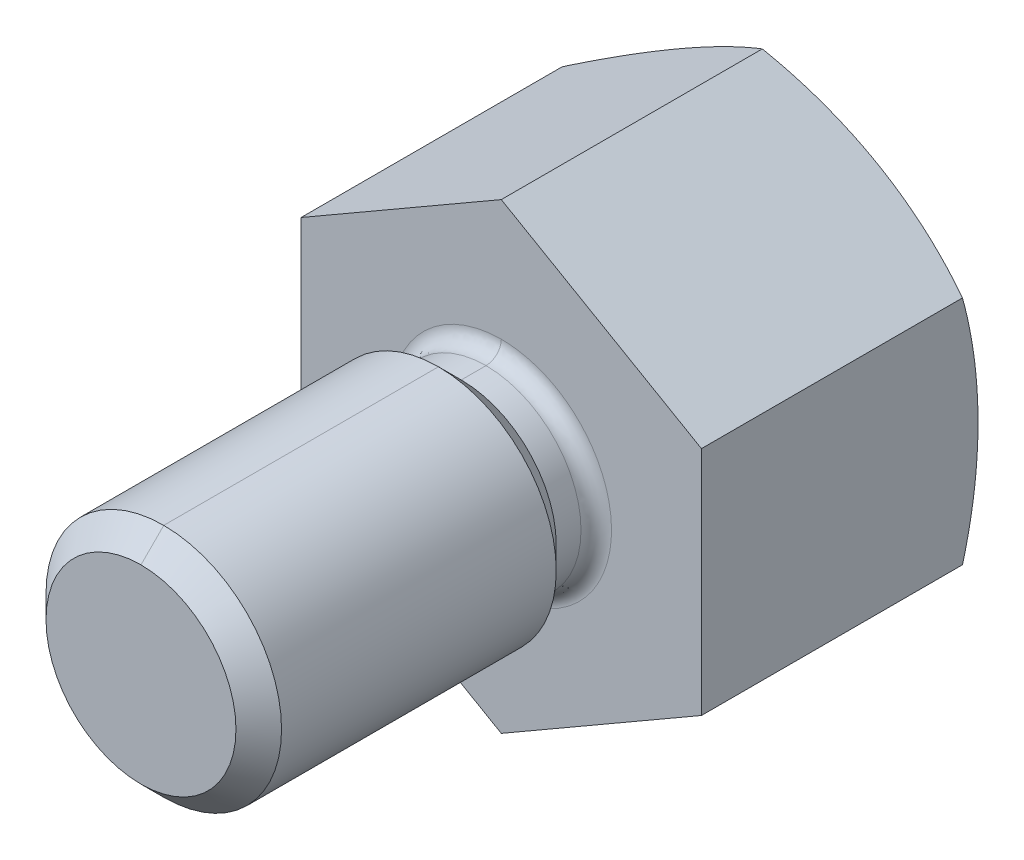
ISO-10303-21;
HEADER;
FILE_DESCRIPTION(('STEP AP214'),'2;1');
FILE_NAME('part.step','',(''),(''),'','','');
FILE_SCHEMA(('AUTOMOTIVE_DESIGN { 1 0 10303 214 1 1 1 1 }'));
ENDSEC;
DATA;
#1=APPLICATION_CONTEXT('core data for automotive mechanical design processes');
#2=APPLICATION_PROTOCOL_DEFINITION('international standard','automotive_design',2000,#1);
#3=PRODUCT_CONTEXT('',#1,'mechanical');
#4=PRODUCT('Part','Part','',(#3));
#5=PRODUCT_RELATED_PRODUCT_CATEGORY('part','',(#4));
#6=PRODUCT_DEFINITION_FORMATION('','',#4);
#7=PRODUCT_DEFINITION_CONTEXT('part definition',#1,'design');
#8=PRODUCT_DEFINITION('design','',#6,#7);
#9=PRODUCT_DEFINITION_SHAPE('','',#8);
#10=(LENGTH_UNIT() NAMED_UNIT(*) SI_UNIT(.MILLI.,.METRE.));
#11=(NAMED_UNIT(*) PLANE_ANGLE_UNIT() SI_UNIT($,.RADIAN.));
#12=(NAMED_UNIT(*) SI_UNIT($,.STERADIAN.) SOLID_ANGLE_UNIT());
#13=UNCERTAINTY_MEASURE_WITH_UNIT(LENGTH_MEASURE(1.E-05),#10,'distance_accuracy_value','');
#14=(GEOMETRIC_REPRESENTATION_CONTEXT(3) GLOBAL_UNCERTAINTY_ASSIGNED_CONTEXT((#13)) GLOBAL_UNIT_ASSIGNED_CONTEXT((#10,
#11,#12)) REPRESENTATION_CONTEXT('',''));
#15=CARTESIAN_POINT('',(0.,0.,0.));
#16=DIRECTION('',(0.,0.,1.));
#17=DIRECTION('',(1.,0.,0.));
#18=AXIS2_PLACEMENT_3D('',#15,#16,#17);
#19=CARTESIAN_POINT('',(-2.40097,-2.40097,17.));
#20=DIRECTION('',(0.,0.,1.));
#21=DIRECTION('',(1.,0.,0.));
#22=AXIS2_PLACEMENT_3D('',#19,#20,#21);
#23=PLANE('',#22);
#24=CARTESIAN_POINT('',(0.,0.,16.9999999999999));
#25=DIRECTION('',(0.,0.,-1.));
#26=DIRECTION('',(-1.,0.,0.));
#27=AXIS2_PLACEMENT_3D('',#24,#25,#26);
#28=CIRCLE('',#27,2.3725000000001);
#29=CARTESIAN_POINT('',(9.7321584094215E-10,2.3725000000001,16.9999999999999));
#30=VERTEX_POINT('',#29);
#31=CARTESIAN_POINT('',(4.26070694257492E-10,-2.3725000000001,16.9999999999999));
#32=VERTEX_POINT('',#31);
#33=EDGE_CURVE('E22',#30,#32,#28,.F.);
#34=ORIENTED_EDGE('',*,*,#33,.T.);
#35=CARTESIAN_POINT('',(0.,0.,16.9999999999999));
#36=DIRECTION('',(0.,0.,-1.));
#37=DIRECTION('',(-1.,0.,0.));
#38=AXIS2_PLACEMENT_3D('',#35,#36,#37);
#39=CIRCLE('',#38,2.3725000000001);
#40=EDGE_CURVE('E63',#32,#30,#39,.F.);
#41=ORIENTED_EDGE('',*,*,#40,.T.);
#42=EDGE_LOOP('',(#34,#41));
#43=FACE_BOUND('',#42,.T.);
#44=ADVANCED_FACE('F17',(#43),#23,.T.);
#45=CARTESIAN_POINT('',(0.,0.,17.));
#46=DIRECTION('',(0.,0.,-1.));
#47=DIRECTION('',(-1.,0.,0.));
#48=AXIS2_PLACEMENT_3D('',#45,#46,#47);
#49=CONICAL_SURFACE('',#48,2.3725,0.785398163397445);
#50=CARTESIAN_POINT('',(0.,0.,16.4305));
#51=DIRECTION('',(0.,0.,-1.));
#52=DIRECTION('',(0.,-1.,0.));
#53=AXIS2_PLACEMENT_3D('',#50,#51,#52);
#54=CIRCLE('',#53,2.942);
#55=CARTESIAN_POINT('',(1.20682857338421E-09,2.942,16.4305));
#56=VERTEX_POINT('',#55);
#57=CARTESIAN_POINT('',(5.28345709674665E-10,-2.942,16.4305));
#58=VERTEX_POINT('',#57);
#59=EDGE_CURVE('E75',#56,#58,#54,.F.);
#60=ORIENTED_EDGE('',*,*,#59,.T.);
#61=DIRECTION('',(1.26987367138604E-10,-0.707106781186545,-0.70710678118655));
#62=VECTOR('',#61,1.);
#63=CARTESIAN_POINT('',(4.77208238284502E-10,-2.65725,16.71525));
#64=LINE('',#63,#62);
#65=EDGE_CURVE('E72',#58,#32,#64,.F.);
#66=ORIENTED_EDGE('',*,*,#65,.T.);
#67=ORIENTED_EDGE('',*,*,#33,.F.);
#68=DIRECTION('',(-2.90060050295601E-10,-0.707106781186545,0.70710678118655));
#69=VECTOR('',#68,1.);
#70=CARTESIAN_POINT('',(1.09002217084473E-09,2.65725,16.71525));
#71=LINE('',#70,#69);
#72=EDGE_CURVE('E80',#30,#56,#71,.F.);
#73=ORIENTED_EDGE('',*,*,#72,.T.);
#74=EDGE_LOOP('',(#60,#66,#67,#73));
#75=FACE_BOUND('',#74,.T.);
#76=ADVANCED_FACE('F73',(#75),#49,.T.);
#77=CARTESIAN_POINT('',(0.,0.,17.));
#78=DIRECTION('',(0.,0.,-1.));
#79=DIRECTION('',(-1.,0.,0.));
#80=AXIS2_PLACEMENT_3D('',#77,#78,#79);
#81=CONICAL_SURFACE('',#80,2.3725,0.785398163397445);
#82=CARTESIAN_POINT('',(0.,0.,16.4305));
#83=DIRECTION('',(0.,0.,-1.));
#84=DIRECTION('',(0.,-1.,0.));
#85=AXIS2_PLACEMENT_3D('',#82,#83,#84);
#86=CIRCLE('',#85,2.942);
#87=EDGE_CURVE('E311',#58,#56,#86,.F.);
#88=ORIENTED_EDGE('',*,*,#87,.T.);
#89=ORIENTED_EDGE('',*,*,#72,.F.);
#90=ORIENTED_EDGE('',*,*,#40,.F.);
#91=ORIENTED_EDGE('',*,*,#65,.F.);
#92=EDGE_LOOP('',(#88,#89,#90,#91));
#93=FACE_BOUND('',#92,.T.);
#94=ADVANCED_FACE('F82',(#93),#81,.T.);
#95=CARTESIAN_POINT('',(0.,0.,16.4305));
#96=DIRECTION('',(0.,0.,-1.));
#97=DIRECTION('',(-1.,0.,0.));
#98=AXIS2_PLACEMENT_3D('',#95,#96,#97);
#99=CYLINDRICAL_SURFACE('',#98,2.942);
#100=DIRECTION('',(0.,0.,-1.));
#101=VECTOR('',#100,1.);
#102=CARTESIAN_POINT('',(5.28345709674665E-10,-2.942,13.));
#103=LINE('',#102,#101);
#104=CARTESIAN_POINT('',(1.03720785745682E-09,-2.942,9.56950000000001));
#105=VERTEX_POINT('',#104);
#106=EDGE_CURVE('E314',#105,#58,#103,.F.);
#107=ORIENTED_EDGE('',*,*,#106,.T.);
#108=ORIENTED_EDGE('',*,*,#59,.F.);
#109=DIRECTION('',(0.,0.,1.));
#110=VECTOR('',#109,1.);
#111=CARTESIAN_POINT('',(1.20682857338421E-09,2.942,13.));
#112=LINE('',#111,#110);
#113=CARTESIAN_POINT('',(6.50690356147078E-10,2.942,9.56950000000001));
#114=VERTEX_POINT('',#113);
#115=EDGE_CURVE('E316',#56,#114,#112,.F.);
#116=ORIENTED_EDGE('',*,*,#115,.T.);
#117=CARTESIAN_POINT('',(0.,0.,9.56950000000001));
#118=DIRECTION('',(0.,0.,1.));
#119=DIRECTION('',(0.,1.,0.));
#120=AXIS2_PLACEMENT_3D('',#117,#118,#119);
#121=CIRCLE('',#120,2.942);
#122=EDGE_CURVE('E306',#114,#105,#121,.T.);
#123=ORIENTED_EDGE('',*,*,#122,.T.);
#124=EDGE_LOOP('',(#107,#108,#116,#123));
#125=FACE_BOUND('',#124,.T.);
#126=ADVANCED_FACE('F410',(#125),#99,.T.);
#127=CARTESIAN_POINT('',(0.,0.,16.4305));
#128=DIRECTION('',(0.,0.,-1.));
#129=DIRECTION('',(-1.,0.,0.));
#130=AXIS2_PLACEMENT_3D('',#127,#128,#129);
#131=CYLINDRICAL_SURFACE('',#130,2.942);
#132=ORIENTED_EDGE('',*,*,#106,.F.);
#133=CARTESIAN_POINT('',(0.,0.,9.56950000000001));
#134=DIRECTION('',(0.,0.,1.));
#135=DIRECTION('',(0.,1.,0.));
#136=AXIS2_PLACEMENT_3D('',#133,#134,#135);
#137=CIRCLE('',#136,2.942);
#138=EDGE_CURVE('E291',#105,#114,#137,.T.);
#139=ORIENTED_EDGE('',*,*,#138,.T.);
#140=ORIENTED_EDGE('',*,*,#115,.F.);
#141=ORIENTED_EDGE('',*,*,#87,.F.);
#142=EDGE_LOOP('',(#132,#139,#140,#141));
#143=FACE_BOUND('',#142,.T.);
#144=ADVANCED_FACE('F419',(#143),#131,.T.);
#145=CARTESIAN_POINT('',(0.,0.,9.));
#146=DIRECTION('',(0.,0.,1.));
#147=DIRECTION('',(1.,0.,0.));
#148=AXIS2_PLACEMENT_3D('',#145,#146,#147);
#149=CONICAL_SURFACE('',#148,2.3725,0.785398163397448);
#150=DIRECTION('',(-2.90060050295602E-10,0.707106781186547,-0.707106781186548));
#151=VECTOR('',#150,1.);
#152=CARTESIAN_POINT('',(1.09002217084473E-09,-2.65725,9.28475));
#153=LINE('',#152,#151);
#154=CARTESIAN_POINT('',(5.62857017247065E-10,-2.3725,9.));
#155=VERTEX_POINT('',#154);
#156=EDGE_CURVE('E294',#155,#105,#153,.F.);
#157=ORIENTED_EDGE('',*,*,#156,.T.);
#158=ORIENTED_EDGE('',*,*,#122,.F.);
#159=DIRECTION('',(1.26987367138605E-10,0.707106781186547,0.707106781186548));
#160=VECTOR('',#159,1.);
#161=CARTESIAN_POINT('',(4.77208238284502E-10,2.65725,9.28475));
#162=LINE('',#161,#160);
#163=CARTESIAN_POINT('',(7.68036392776157E-10,2.3725,9.));
#164=VERTEX_POINT('',#163);
#165=EDGE_CURVE('E297',#114,#164,#162,.F.);
#166=ORIENTED_EDGE('',*,*,#165,.T.);
#167=CARTESIAN_POINT('',(0.,0.,9.));
#168=DIRECTION('',(0.,0.,-1.));
#169=DIRECTION('',(0.,-1.,0.));
#170=AXIS2_PLACEMENT_3D('',#167,#168,#169);
#171=CIRCLE('',#170,2.3725);
#172=EDGE_CURVE('E286',#164,#155,#171,.F.);
#173=ORIENTED_EDGE('',*,*,#172,.T.);
#174=EDGE_LOOP('',(#157,#158,#166,#173));
#175=FACE_BOUND('',#174,.T.);
#176=ADVANCED_FACE('F413',(#175),#149,.T.);
#177=CARTESIAN_POINT('',(0.,0.,9.));
#178=DIRECTION('',(0.,0.,1.));
#179=DIRECTION('',(1.,0.,0.));
#180=AXIS2_PLACEMENT_3D('',#177,#178,#179);
#181=CONICAL_SURFACE('',#180,2.3725,0.785398163397448);
#182=ORIENTED_EDGE('',*,*,#156,.F.);
#183=CARTESIAN_POINT('',(0.,0.,9.));
#184=DIRECTION('',(0.,0.,-1.));
#185=DIRECTION('',(0.,-1.,0.));
#186=AXIS2_PLACEMENT_3D('',#183,#184,#185);
#187=CIRCLE('',#186,2.3725);
#188=EDGE_CURVE('E268',#155,#164,#187,.F.);
#189=ORIENTED_EDGE('',*,*,#188,.T.);
#190=ORIENTED_EDGE('',*,*,#165,.F.);
#191=ORIENTED_EDGE('',*,*,#138,.F.);
#192=EDGE_LOOP('',(#182,#189,#190,#191));
#193=FACE_BOUND('',#192,.T.);
#194=ADVANCED_FACE('F421',(#193),#181,.T.);
#195=CARTESIAN_POINT('',(0.,0.,9.));
#196=DIRECTION('',(0.,0.,-1.));
#197=DIRECTION('',(-1.,0.,0.));
#198=AXIS2_PLACEMENT_3D('',#195,#196,#197);
#199=CYLINDRICAL_SURFACE('',#198,2.3725);
#200=DIRECTION('',(0.,0.,-1.));
#201=VECTOR('',#200,1.);
#202=CARTESIAN_POINT('',(4.26070766894338E-10,-2.3725,8.6905));
#203=LINE('',#202,#201);
#204=CARTESIAN_POINT('',(1.06517691723585E-10,-2.37249999998408,8.38099999998617));
#205=VERTEX_POINT('',#204);
#206=EDGE_CURVE('E271',#205,#155,#203,.F.);
#207=ORIENTED_EDGE('',*,*,#206,.T.);
#208=ORIENTED_EDGE('',*,*,#172,.F.);
#209=DIRECTION('',(0.,0.,1.));
#210=VECTOR('',#209,1.);
#211=CARTESIAN_POINT('',(9.73215768305246E-10,2.3725,8.6905));
#212=LINE('',#211,#210);
#213=CARTESIAN_POINT('',(3.64955913113923E-10,2.37249999998408,8.38099999998617));
#214=VERTEX_POINT('',#213);
#215=EDGE_CURVE('E274',#164,#214,#212,.F.);
#216=ORIENTED_EDGE('',*,*,#215,.T.);
#217=CARTESIAN_POINT('',(0.,0.,8.38099999998617));
#218=DIRECTION('',(0.,0.,1.));
#219=DIRECTION('',(1.,0.,0.));
#220=AXIS2_PLACEMENT_3D('',#217,#218,#219);
#221=CIRCLE('',#220,2.37249999997877);
#222=EDGE_CURVE('E260',#214,#205,#221,.T.);
#223=ORIENTED_EDGE('',*,*,#222,.T.);
#224=EDGE_LOOP('',(#207,#208,#216,#223));
#225=FACE_BOUND('',#224,.T.);
#226=ADVANCED_FACE('F429',(#225),#199,.T.);
#227=CARTESIAN_POINT('',(0.,0.,9.));
#228=DIRECTION('',(0.,0.,-1.));
#229=DIRECTION('',(-1.,0.,0.));
#230=AXIS2_PLACEMENT_3D('',#227,#228,#229);
#231=CYLINDRICAL_SURFACE('',#230,2.3725);
#232=ORIENTED_EDGE('',*,*,#206,.F.);
#233=CARTESIAN_POINT('',(0.,0.,8.38099999998617));
#234=DIRECTION('',(0.,0.,1.));
#235=DIRECTION('',(1.,0.,0.));
#236=AXIS2_PLACEMENT_3D('',#233,#234,#235);
#237=CIRCLE('',#236,2.37249999997877);
#238=EDGE_CURVE('E277',#205,#214,#237,.T.);
#239=ORIENTED_EDGE('',*,*,#238,.T.);
#240=ORIENTED_EDGE('',*,*,#215,.F.);
#241=ORIENTED_EDGE('',*,*,#188,.F.);
#242=EDGE_LOOP('',(#232,#239,#240,#241));
#243=FACE_BOUND('',#242,.T.);
#244=ADVANCED_FACE('F245',(#243),#231,.T.);
#245=CARTESIAN_POINT('',(0.,-2.374403413,8.41903653200001));
#246=CARTESIAN_POINT('',(-4.748806826,-2.374403413,8.41903653200001));
#247=CARTESIAN_POINT('',(-4.748806826,2.374403413,8.41903653200001));
#248=CARTESIAN_POINT('',(0.,2.374403413,8.41903653200001));
#249=CARTESIAN_POINT('',(0.,-2.348413019,8.159999515));
#250=CARTESIAN_POINT('',(-4.696826038,-2.348413019,8.159999515));
#251=CARTESIAN_POINT('',(-4.696826038,2.348413019,8.159999515));
#252=CARTESIAN_POINT('',(0.,2.348413019,8.159999515));
#253=CARTESIAN_POINT('',(0.,-2.532499515,7.975913019));
#254=CARTESIAN_POINT('',(-5.064999031,-2.532499515,7.975913019));
#255=CARTESIAN_POINT('',(-5.064999031,2.532499515,7.975913019));
#256=CARTESIAN_POINT('',(0.,2.532499515,7.975913019));
#257=CARTESIAN_POINT('',(0.,-2.791536532,8.001903413));
#258=CARTESIAN_POINT('',(-5.583073063,-2.791536532,8.001903413));
#259=CARTESIAN_POINT('',(-5.583073063,2.791536532,8.001903413));
#260=CARTESIAN_POINT('',(0.,2.791536532,8.001903413));
#261=(BOUNDED_SURFACE() B_SPLINE_SURFACE(3,3,((#245,#246,#247,#248),(#249,#250,#251,#252),(#253,
#254,#255,#256),(#257,#258,#259,#260)),.UNSPECIFIED.,.F.,.F.,
.F.) B_SPLINE_SURFACE_WITH_KNOTS((4,4),(4,4),(0.,1.),(0.,1.),
.UNSPECIFIED.) GEOMETRIC_REPRESENTATION_ITEM() RATIONAL_B_SPLINE_SURFACE(((1.,0.333333333333333,
0.333333333333333,1.),(0.755320871117972,0.251773623705991,0.251773623705991,0.755320871117972),
(0.755320871117972,0.251773623705991,0.251773623705991,0.755320871117972),(1.,0.333333333333333,
0.333333333333333,1.))) REPRESENTATION_ITEM('') SURFACE());
#262=CARTESIAN_POINT('',(0.,-2.374403413,8.41903653200001));
#263=CARTESIAN_POINT('',(0.,-2.348413019,8.159999515));
#264=CARTESIAN_POINT('',(0.,-2.532499515,7.975913019));
#265=CARTESIAN_POINT('',(0.,-2.791536532,8.001903413));
#266=(BOUNDED_CURVE() B_SPLINE_CURVE(3,(#262,#263,#264,#265),.UNSPECIFIED.,.F.,
.F.) B_SPLINE_CURVE_WITH_KNOTS((4,4),(0.,1.),
.UNSPECIFIED.) CURVE() GEOMETRIC_REPRESENTATION_ITEM() RATIONAL_B_SPLINE_CURVE((1.,
0.755320871117972,0.755320871117972,1.)) REPRESENTATION_ITEM(''));
#267=CARTESIAN_POINT('',(0.,-2.7535000006185,7.99999999998726));
#268=VERTEX_POINT('',#267);
#269=EDGE_CURVE('E281',#268,#205,#266,.F.);
#270=CARTESIAN_POINT('',(0.,2.374403413,8.41903653200001));
#271=CARTESIAN_POINT('',(0.,2.348413019,8.159999515));
#272=CARTESIAN_POINT('',(0.,2.532499515,7.975913019));
#273=CARTESIAN_POINT('',(0.,2.791536532,8.001903413));
#274=(BOUNDED_CURVE() B_SPLINE_CURVE(3,(#270,#271,#272,#273),.UNSPECIFIED.,.F.,
.F.) B_SPLINE_CURVE_WITH_KNOTS((4,4),(0.,1.),
.UNSPECIFIED.) CURVE() GEOMETRIC_REPRESENTATION_ITEM() RATIONAL_B_SPLINE_CURVE((1.,
0.755320871117972,0.755320871117972,1.)) REPRESENTATION_ITEM(''));
#275=CARTESIAN_POINT('',(0.,2.7535000006185,7.99999999998726));
#276=VERTEX_POINT('',#275);
#277=EDGE_CURVE('E221',#214,#276,#274,.T.);
#278=CARTESIAN_POINT('',(0.,2.75350000016945,7.99999999997877));
#279=CARTESIAN_POINT('',(-5.50699999961057,2.75350000016945,7.99999999997878));
#280=CARTESIAN_POINT('',(-5.50699999961057,-2.75350000016945,7.99999999997878));
#281=CARTESIAN_POINT('',(0.,-2.75350000016945,7.99999999997877));
#282=(BOUNDED_CURVE() B_SPLINE_CURVE(3,(#278,#279,#280,#281),.UNSPECIFIED.,.F.,
.F.) B_SPLINE_CURVE_WITH_KNOTS((4,4),(0.,1.),
.UNSPECIFIED.) CURVE() GEOMETRIC_REPRESENTATION_ITEM() RATIONAL_B_SPLINE_CURVE((0.956578302356605,
0.318859434118868,0.318859434118868,0.956578302356605)) REPRESENTATION_ITEM(''));
#283=EDGE_CURVE('E280',#276,#268,#282,.T.);
#284=ORIENTED_EDGE('',*,*,#269,.T.);
#285=ORIENTED_EDGE('',*,*,#222,.F.);
#286=ORIENTED_EDGE('',*,*,#277,.T.);
#287=ORIENTED_EDGE('',*,*,#283,.T.);
#288=EDGE_LOOP('',(#284,#285,#286,#287));
#289=FACE_BOUND('',#288,.T.);
#290=ADVANCED_FACE('F234',(#289),#261,.F.);
#291=CARTESIAN_POINT('',(0.,2.374403413,8.41903653200001));
#292=CARTESIAN_POINT('',(4.748806826,2.374403413,8.41903653200001));
#293=CARTESIAN_POINT('',(4.748806826,-2.374403413,8.41903653200001));
#294=CARTESIAN_POINT('',(0.,-2.374403413,8.41903653200001));
#295=CARTESIAN_POINT('',(0.,2.348413019,8.159999515));
#296=CARTESIAN_POINT('',(4.696826038,2.348413019,8.159999515));
#297=CARTESIAN_POINT('',(4.696826038,-2.348413019,8.159999515));
#298=CARTESIAN_POINT('',(0.,-2.348413019,8.159999515));
#299=CARTESIAN_POINT('',(0.,2.532499515,7.975913019));
#300=CARTESIAN_POINT('',(5.064999031,2.532499515,7.975913019));
#301=CARTESIAN_POINT('',(5.064999031,-2.532499515,7.975913019));
#302=CARTESIAN_POINT('',(0.,-2.532499515,7.975913019));
#303=CARTESIAN_POINT('',(0.,2.791536532,8.001903413));
#304=CARTESIAN_POINT('',(5.583073063,2.791536532,8.001903413));
#305=CARTESIAN_POINT('',(5.583073063,-2.791536532,8.001903413));
#306=CARTESIAN_POINT('',(0.,-2.791536532,8.001903413));
#307=(BOUNDED_SURFACE() B_SPLINE_SURFACE(3,3,((#291,#292,#293,#294),(#295,#296,#297,#298),(#299,
#300,#301,#302),(#303,#304,#305,#306)),.UNSPECIFIED.,.F.,.F.,
.F.) B_SPLINE_SURFACE_WITH_KNOTS((4,4),(4,4),(0.,1.),(0.,1.),
.UNSPECIFIED.) GEOMETRIC_REPRESENTATION_ITEM() RATIONAL_B_SPLINE_SURFACE(((1.,0.333333333333333,
0.333333333333333,1.),(0.755320871117972,0.251773623705991,0.251773623705991,0.755320871117972),
(0.755320871117972,0.251773623705991,0.251773623705991,0.755320871117972),(1.,0.333333333333333,
0.333333333333333,1.))) REPRESENTATION_ITEM('') SURFACE());
#308=CARTESIAN_POINT('',(0.,-2.75350000016945,7.99999999997877));
#309=CARTESIAN_POINT('',(5.50699999961057,-2.75350000016945,7.99999999997878));
#310=CARTESIAN_POINT('',(5.50699999961057,2.75350000016945,7.99999999997878));
#311=CARTESIAN_POINT('',(0.,2.75350000016945,7.99999999997877));
#312=(BOUNDED_CURVE() B_SPLINE_CURVE(3,(#308,#309,#310,#311),.UNSPECIFIED.,.F.,
.F.) B_SPLINE_CURVE_WITH_KNOTS((4,4),(0.,1.),
.UNSPECIFIED.) CURVE() GEOMETRIC_REPRESENTATION_ITEM() RATIONAL_B_SPLINE_CURVE((0.956578302356605,
0.318859434118868,0.318859434118868,0.956578302356605)) REPRESENTATION_ITEM(''));
#313=EDGE_CURVE('E207',#268,#276,#312,.T.);
#314=ORIENTED_EDGE('',*,*,#269,.F.);
#315=ORIENTED_EDGE('',*,*,#313,.T.);
#316=ORIENTED_EDGE('',*,*,#277,.F.);
#317=ORIENTED_EDGE('',*,*,#238,.F.);
#318=EDGE_LOOP('',(#314,#315,#316,#317));
#319=FACE_BOUND('',#318,.T.);
#320=ADVANCED_FACE('F223',(#319),#307,.F.);
#321=CARTESIAN_POINT('',(5.,5.842784724,8.));
#322=DIRECTION('',(0.,0.,-1.));
#323=DIRECTION('',(0.,-1.,0.));
#324=AXIS2_PLACEMENT_3D('',#321,#322,#323);
#325=PLANE('',#324);
#326=ORIENTED_EDGE('',*,*,#283,.F.);
#327=ORIENTED_EDGE('',*,*,#313,.F.);
#328=EDGE_LOOP('',(#326,#327));
#329=FACE_BOUND('',#328,.T.);
#330=DIRECTION('',(-0.866025403780548,0.500000000006738,0.));
#331=VECTOR('',#330,1.);
#332=CARTESIAN_POINT('',(-2.5,-4.330127019,8.));
#333=LINE('',#332,#331);
#334=CARTESIAN_POINT('',(0.,-5.773502692,8.));
#335=VERTEX_POINT('',#334);
#336=CARTESIAN_POINT('',(-5.00000000011417,-2.88675134590112,8.));
#337=VERTEX_POINT('',#336);
#338=EDGE_CURVE('E93',#335,#337,#333,.T.);
#339=ORIENTED_EDGE('',*,*,#338,.F.);
#340=DIRECTION('',(-0.866025403780548,-0.500000000006738,0.));
#341=VECTOR('',#340,1.);
#342=CARTESIAN_POINT('',(2.5,-4.330127019,8.));
#343=LINE('',#342,#341);
#344=CARTESIAN_POINT('',(5.,-2.886751346,8.));
#345=VERTEX_POINT('',#344);
#346=EDGE_CURVE('E170',#345,#335,#343,.T.);
#347=ORIENTED_EDGE('',*,*,#346,.F.);
#348=DIRECTION('',(0.,-1.,0.));
#349=VECTOR('',#348,1.);
#350=CARTESIAN_POINT('',(5.,0.,8.));
#351=LINE('',#350,#349);
#352=CARTESIAN_POINT('',(5.,2.886751346,8.));
#353=VERTEX_POINT('',#352);
#354=EDGE_CURVE('E182',#353,#345,#351,.T.);
#355=ORIENTED_EDGE('',*,*,#354,.F.);
#356=DIRECTION('',(0.866025403780548,-0.500000000006738,0.));
#357=VECTOR('',#356,1.);
#358=CARTESIAN_POINT('',(2.5,4.330127019,8.));
#359=LINE('',#358,#357);
#360=CARTESIAN_POINT('',(0.,5.773502692,8.));
#361=VERTEX_POINT('',#360);
#362=EDGE_CURVE('E176',#361,#353,#359,.T.);
#363=ORIENTED_EDGE('',*,*,#362,.F.);
#364=DIRECTION('',(0.866025403780548,0.500000000006738,0.));
#365=VECTOR('',#364,1.);
#366=CARTESIAN_POINT('',(-2.5,4.330127019,8.));
#367=LINE('',#366,#365);
#368=CARTESIAN_POINT('',(-5.,2.886751346,8.));
#369=VERTEX_POINT('',#368);
#370=EDGE_CURVE('E164',#369,#361,#367,.T.);
#371=ORIENTED_EDGE('',*,*,#370,.F.);
#372=DIRECTION('',(0.,1.,0.));
#373=VECTOR('',#372,1.);
#374=CARTESIAN_POINT('',(-5.,0.,8.));
#375=LINE('',#374,#373);
#376=EDGE_CURVE('E158',#337,#369,#375,.T.);
#377=ORIENTED_EDGE('',*,*,#376,.F.);
#378=EDGE_LOOP('',(#339,#347,#355,#363,#371,#377));
#379=FACE_BOUND('',#378,.T.);
#380=ADVANCED_FACE('F109',(#329,#379),#325,.F.);
#381=CARTESIAN_POINT('',(5.,-2.886751346,1.049835613));
#382=DIRECTION('',(1.,0.,0.));
#383=DIRECTION('',(0.,1.,0.));
#384=AXIS2_PLACEMENT_3D('',#381,#382,#383);
#385=PLANE('',#384);
#386=DIRECTION('',(0.,0.,-1.));
#387=VECTOR('',#386,1.);
#388=CARTESIAN_POINT('',(5.,2.886751346,4.5249178065));
#389=LINE('',#388,#387);
#390=CARTESIAN_POINT('',(5.,2.88675133250463,1.48017743765114));
#391=VERTEX_POINT('',#390);
#392=EDGE_CURVE('E179',#353,#391,#389,.T.);
#393=ORIENTED_EDGE('',*,*,#392,.F.);
#394=ORIENTED_EDGE('',*,*,#354,.T.);
#395=DIRECTION('',(0.,0.,1.));
#396=VECTOR('',#395,1.);
#397=CARTESIAN_POINT('',(5.,-2.886751346,4.5249178065));
#398=LINE('',#397,#396);
#399=CARTESIAN_POINT('',(4.99999998855586,-2.88675135260728,1.4801774377282));
#400=VERTEX_POINT('',#399);
#401=EDGE_CURVE('E173',#400,#345,#398,.T.);
#402=ORIENTED_EDGE('',*,*,#401,.F.);
#403=CARTESIAN_POINT('',(5.,-2.88675131908136,1.48017743392114));
#404=CARTESIAN_POINT('',(5.,-2.58773930594945,1.39809022718953));
#405=CARTESIAN_POINT('',(5.,-2.28521603123794,1.32881784783178));
#406=CARTESIAN_POINT('',(5.,-1.67529536795224,1.21624450557874));
#407=CARTESIAN_POINT('',(5.,-1.36789676623762,1.17295011432652));
#408=CARTESIAN_POINT('',(5.,-0.75731943524405,1.11337905831435));
#409=CARTESIAN_POINT('',(5.,-0.454196681165622,1.09652887313793));
#410=CARTESIAN_POINT('',(5.,0.152259449857844,1.08813629300112));
#411=CARTESIAN_POINT('',(5.,0.455592705916145,1.09658445182193));
#412=CARTESIAN_POINT('',(5.,1.11532157408341,1.14255142423559));
#413=CARTESIAN_POINT('',(5.,1.47139073922539,1.18505215183864));
#414=CARTESIAN_POINT('',(5.,2.0032768829459,1.27526893089731));
#415=CARTESIAN_POINT('',(5.,2.18138255608789,1.31007486348796));
#416=CARTESIAN_POINT('',(5.,2.53563109600457,1.38852184452721));
#417=CARTESIAN_POINT('',(5.,2.71177402956785,1.43216259136792));
#418=CARTESIAN_POINT('',(5.,2.88675131900926,1.48017743390135));
#419=B_SPLINE_CURVE_WITH_KNOTS('',3,(#403,#404,#405,#406,#407,#408,#409,#410,#411,#412,#413,
#414,#415,#416,#417,#418),.UNSPECIFIED.,.F.,.F.,(4,2,2,2,2,2,2,4),(0.,0.929934636862644,
1.8601044199135,2.76980732234372,3.67917059064512,4.75302008955238,5.29725205125433,
5.84146543678988),.UNSPECIFIED.);
#420=EDGE_CURVE('E85',#400,#391,#419,.T.);
#421=ORIENTED_EDGE('',*,*,#420,.T.);
#422=EDGE_LOOP('',(#393,#394,#402,#421));
#423=FACE_BOUND('',#422,.T.);
#424=ADVANCED_FACE('F104',(#423),#385,.T.);
#425=CARTESIAN_POINT('',(5.,2.886751346,1.049835613));
#426=DIRECTION('',(0.500000000006738,0.866025403780548,0.));
#427=DIRECTION('',(-0.866025403780548,0.500000000006738,0.));
#428=AXIS2_PLACEMENT_3D('',#425,#426,#427);
#429=PLANE('',#428);
#430=DIRECTION('',(0.,0.,-1.));
#431=VECTOR('',#430,1.);
#432=CARTESIAN_POINT('',(0.,5.773502692,4.5249178065));
#433=LINE('',#432,#431);
#434=CARTESIAN_POINT('',(1.6724881441919E-08,5.77350268234389,1.48017743607628));
#435=VERTEX_POINT('',#434);
#436=EDGE_CURVE('E167',#361,#435,#433,.T.);
#437=ORIENTED_EDGE('',*,*,#436,.F.);
#438=ORIENTED_EDGE('',*,*,#362,.T.);
#439=ORIENTED_EDGE('',*,*,#392,.T.);
#440=CARTESIAN_POINT('',(4.99999997717415,2.88675135917851,1.48017743407525));
#441=CARTESIAN_POINT('',(4.74104797777612,3.03625736574084,1.39809022733287));
#442=CARTESIAN_POINT('',(4.47905513665045,3.18751900309322,1.32881784796359));
#443=CARTESIAN_POINT('',(3.95084834797159,3.49247933473022,1.21624450568585));
#444=CARTESIAN_POINT('',(3.68463334980796,3.64617863558508,1.17295011442052));
#445=CARTESIAN_POINT('',(3.1558578701983,3.95146730108407,1.11337905837987));
#446=CARTESIAN_POINT('',(2.89334586469783,4.103028678128,1.09652887318921));
#447=CARTESIAN_POINT('',(2.36813944894296,4.40625674364964,1.08813629302515));
#448=CARTESIAN_POINT('',(2.10544514337955,4.55792337168399,1.09658445183288));
#449=CARTESIAN_POINT('',(1.53410318557015,4.8877878048305,1.14255142408657));
#450=CARTESIAN_POINT('',(1.22573824468017,5.06582238646517,1.18505215135593));
#451=CARTESIAN_POINT('',(0.765111334707964,5.33176545693839,1.27526892963438));
#452=CARTESIAN_POINT('',(0.610867298020148,5.42081829304259,1.31007486191294));
#453=CARTESIAN_POINT('',(0.304079064796387,5.59794256208172,1.38852184223451));
#454=CARTESIAN_POINT('',(0.151534810419826,5.68601402841094,1.43216258866966));
#455=CARTESIAN_POINT('',(3.34497628838379E-08,5.77350267268777,1.48017743075164));
#456=B_SPLINE_CURVE_WITH_KNOTS('',3,(#440,#441,#442,#443,#444,#445,#446,#447,#448,#449,#450,
#451,#452,#453,#454,#455),.UNSPECIFIED.,.F.,.F.,(4,2,2,2,2,2,2,4),(0.,0.92993463683872,
1.86010441986813,2.76980732231703,3.67917059063471,4.75302008386314,5.29725204263272,
5.84146542523691),.UNSPECIFIED.);
#457=EDGE_CURVE('E92',#391,#435,#456,.T.);
#458=ORIENTED_EDGE('',*,*,#457,.T.);
#459=EDGE_LOOP('',(#437,#438,#439,#458));
#460=FACE_BOUND('',#459,.T.);
#461=ADVANCED_FACE('F108',(#460),#429,.T.);
#462=CARTESIAN_POINT('',(0.,-5.773502692,1.049835613));
#463=DIRECTION('',(0.500000000006738,-0.866025403780548,0.));
#464=DIRECTION('',(0.866025403780548,0.500000000006738,0.));
#465=AXIS2_PLACEMENT_3D('',#462,#463,#464);
#466=PLANE('',#465);
#467=ORIENTED_EDGE('',*,*,#401,.T.);
#468=ORIENTED_EDGE('',*,*,#346,.T.);
#469=DIRECTION('',(0.,0.,1.));
#470=VECTOR('',#469,1.);
#471=CARTESIAN_POINT('',(0.,-5.773502692,4.5249178065));
#472=LINE('',#471,#470);
#473=CARTESIAN_POINT('',(9.4392004001884E-10,-5.77350267292636,1.48017743088258));
#474=VERTEX_POINT('',#473);
#475=EDGE_CURVE('E150',#474,#335,#472,.T.);
#476=ORIENTED_EDGE('',*,*,#475,.F.);
#477=CARTESIAN_POINT('',(3.39804395172434E-08,-5.77350267238139,1.48017743058349));
#478=CARTESIAN_POINT('',(0.258952033464085,-5.62399666576963,1.3980902242029));
#479=CARTESIAN_POINT('',(0.520944874661954,-5.47273502837556,1.32881784519962));
#480=CARTESIAN_POINT('',(1.04915166345802,-5.16777469667089,1.21624450365971));
#481=CARTESIAN_POINT('',(1.31536666166667,-5.01407539579005,1.17295011276621));
#482=CARTESIAN_POINT('',(1.84414214133875,-4.70878673025501,1.11337905746396));
#483=CARTESIAN_POINT('',(2.10665414685725,-4.55722535320067,1.09652887263987));
#484=CARTESIAN_POINT('',(2.63186056262164,-4.25399728767353,1.0881362932093));
#485=CARTESIAN_POINT('',(2.89455486817656,-4.10233065964409,1.09658445238394));
#486=CARTESIAN_POINT('',(3.46589682583749,-3.7724662265833,1.14255142542754));
#487=CARTESIAN_POINT('',(3.77426176658289,-3.5944316450321,1.18505215310801));
#488=CARTESIAN_POINT('',(4.2348886763123,-3.32848857469906,1.27526893198326));
#489=CARTESIAN_POINT('',(4.38913271291374,-3.23943573864473,1.31007486445853));
#490=CARTESIAN_POINT('',(4.695920945957,-3.0623114697098,1.38852184516541));
#491=CARTESIAN_POINT('',(4.84846520023945,-2.97424000343492,1.43216259178914));
#492=CARTESIAN_POINT('',(4.99999997711171,-2.88675135921456,1.48017743405547));
#493=B_SPLINE_CURVE_WITH_KNOTS('',3,(#477,#478,#479,#480,#481,#482,#483,#484,#485,#486,#487,
#488,#489,#490,#491,#492),.UNSPECIFIED.,.F.,.F.,(4,2,2,2,2,2,2,4),(0.,0.92993463683741,
1.86010441986566,2.76980732231587,3.67917059063471,4.753020083514,5.2972520421033,
5.84146542452726),.UNSPECIFIED.);
#494=EDGE_CURVE('E124',#474,#400,#493,.T.);
#495=ORIENTED_EDGE('',*,*,#494,.T.);
#496=EDGE_LOOP('',(#467,#468,#476,#495));
#497=FACE_BOUND('',#496,.T.);
#498=ADVANCED_FACE('F116',(#497),#466,.T.);
#499=CARTESIAN_POINT('',(0.,5.773502692,1.049835613));
#500=DIRECTION('',(-0.500000000006738,0.866025403780548,0.));
#501=DIRECTION('',(-0.866025403780548,-0.500000000006738,0.));
#502=AXIS2_PLACEMENT_3D('',#499,#500,#501);
#503=PLANE('',#502);
#504=DIRECTION('',(0.,0.,-1.));
#505=VECTOR('',#504,1.);
#506=CARTESIAN_POINT('',(-5.,2.886751346,4.5249178065));
#507=LINE('',#506,#505);
#508=CARTESIAN_POINT('',(-4.9999999882978,2.88675135275627,1.48017743764643));
#509=VERTEX_POINT('',#508);
#510=EDGE_CURVE('E161',#369,#509,#507,.T.);
#511=ORIENTED_EDGE('',*,*,#510,.F.);
#512=ORIENTED_EDGE('',*,*,#370,.T.);
#513=ORIENTED_EDGE('',*,*,#436,.T.);
#514=CARTESIAN_POINT('',(-3.2623277482713E-08,5.77350267316495,1.48017743101352));
#515=CARTESIAN_POINT('',(-0.258952032096853,5.623996666559,1.39809022458822));
#516=CARTESIAN_POINT('',(-0.520944873286312,5.47273502916979,1.32881784553977));
#517=CARTESIAN_POINT('',(-1.04915166206886,5.16777469747292,1.21624450390889));
#518=CARTESIAN_POINT('',(-1.3153666602724,5.01407539659502,1.1729501129696));
#519=CARTESIAN_POINT('',(-1.84414213993677,4.70878673106444,1.1133790575766));
#520=CARTESIAN_POINT('',(-2.10665414545256,4.55722535401167,1.09652887270746));
#521=CARTESIAN_POINT('',(-2.63186056121484,4.25399728848575,1.08813629318664));
#522=CARTESIAN_POINT('',(-2.89455486677034,4.10233066045598,1.0965844523161));
#523=CARTESIAN_POINT('',(-3.46589682457946,3.77246622730963,1.14255142527288));
#524=CARTESIAN_POINT('',(-3.77426176547223,3.59443164567334,1.18505215292807));
#525=CARTESIAN_POINT('',(-4.23488867542356,3.32848857521218,1.27526893179012));
#526=CARTESIAN_POINT('',(-4.38913271210027,3.23943573911438,1.31007486426541));
#527=CARTESIAN_POINT('',(-4.69592094529308,3.06231147009313,1.38852184498076));
#528=CARTESIAN_POINT('',(-4.84846519964979,2.97424000377536,1.43216259161296));
#529=CARTESIAN_POINT('',(-4.9999999765956,2.88675135951253,1.48017743389193));
#530=B_SPLINE_CURVE_WITH_KNOTS('',3,(#514,#515,#516,#517,#518,#519,#520,#521,#522,#523,#524,
#525,#526,#527,#528,#529),.UNSPECIFIED.,.F.,.F.,(4,2,2,2,2,2,2,4),(0.,0.929934636839267,
1.86010441986916,2.76980732231752,3.67917059063471,4.7530200840091,5.29725204285404,
5.84146542553357),.UNSPECIFIED.);
#531=EDGE_CURVE('E130',#435,#509,#530,.T.);
#532=ORIENTED_EDGE('',*,*,#531,.T.);
#533=EDGE_LOOP('',(#511,#512,#513,#532));
#534=FACE_BOUND('',#533,.T.);
#535=ADVANCED_FACE('F121',(#534),#503,.T.);
#536=CARTESIAN_POINT('',(-5.,2.886751346,1.049835613));
#537=DIRECTION('',(-1.,0.,0.));
#538=DIRECTION('',(0.,-1.,0.));
#539=AXIS2_PLACEMENT_3D('',#536,#537,#538);
#540=PLANE('',#539);
#541=DIRECTION('',(0.,0.,-1.));
#542=VECTOR('',#541,1.);
#543=CARTESIAN_POINT('',(-5.,-2.886751346,4.5249178065));
#544=LINE('',#543,#542);
#545=CARTESIAN_POINT('',(-5.,-2.88675133229016,1.48017743759229));
#546=VERTEX_POINT('',#545);
#547=EDGE_CURVE('E153',#337,#546,#544,.T.);
#548=ORIENTED_EDGE('',*,*,#547,.F.);
#549=ORIENTED_EDGE('',*,*,#376,.T.);
#550=ORIENTED_EDGE('',*,*,#510,.T.);
#551=CARTESIAN_POINT('',(-5.,2.88675131967731,1.48017743408467));
#552=CARTESIAN_POINT('',(-5.,2.58773930654995,1.39809022733609));
#553=CARTESIAN_POINT('',(-5.,2.28521603184226,1.32881784796119));
#554=CARTESIAN_POINT('',(-5.,1.67529536856274,1.21624450567358));
#555=CARTESIAN_POINT('',(-5.,1.36789676685047,1.17295011440394));
#556=CARTESIAN_POINT('',(-5.,0.757319435860285,1.11337905835722));
#557=CARTESIAN_POINT('',(-5.,0.454196681782915,1.09652887316365));
#558=CARTESIAN_POINT('',(-5.,-0.152259449239871,1.0881362929925));
#559=CARTESIAN_POINT('',(-5.,-0.455592705298549,1.09658445179612));
#560=CARTESIAN_POINT('',(-5.,-1.11532157349667,1.14255142417438));
#561=CARTESIAN_POINT('',(-5.,-1.47139073866923,1.18505215176203));
#562=CARTESIAN_POINT('',(-5.,-2.00327688243661,1.27526893080193));
#563=CARTESIAN_POINT('',(-5.,-2.18138255559463,1.31007486338705));
#564=CARTESIAN_POINT('',(-5.,-2.53563109554343,1.38852184441677));
#565=CARTESIAN_POINT('',(-5.,-2.71177402912282,1.43216259125347));
#566=CARTESIAN_POINT('',(-5.,-2.88675131858033,1.48017743378365));
#567=B_SPLINE_CURVE_WITH_KNOTS('',3,(#551,#552,#553,#554,#555,#556,#557,#558,#559,#560,#561,
#562,#563,#564,#565,#566),.UNSPECIFIED.,.F.,.F.,(4,2,2,2,2,2,2,4),(0.,0.929934636862963,
1.86010441991411,2.76980732234401,3.67917059064512,4.75302008963753,5.29725205138344,
5.84146543696294),.UNSPECIFIED.);
#568=EDGE_CURVE('E135',#509,#546,#567,.T.);
#569=ORIENTED_EDGE('',*,*,#568,.T.);
#570=EDGE_LOOP('',(#548,#549,#550,#569));
#571=FACE_BOUND('',#570,.T.);
#572=ADVANCED_FACE('F367',(#571),#540,.T.);
#573=CARTESIAN_POINT('',(-5.,-2.886751346,1.049835613));
#574=DIRECTION('',(-0.500000000006738,-0.866025403780548,0.));
#575=DIRECTION('',(0.866025403780548,-0.500000000006738,0.));
#576=AXIS2_PLACEMENT_3D('',#573,#574,#575);
#577=PLANE('',#576);
#578=ORIENTED_EDGE('',*,*,#475,.T.);
#579=ORIENTED_EDGE('',*,*,#338,.T.);
#580=ORIENTED_EDGE('',*,*,#547,.T.);
#581=CARTESIAN_POINT('',(-4.99999997754562,-2.88675135896404,1.48017743419296));
#582=CARTESIAN_POINT('',(-4.74104797814942,-3.03625736552531,1.39809022743804));
#583=CARTESIAN_POINT('',(-4.47905513702511,-3.18751900287691,1.32881784805619));
#584=CARTESIAN_POINT('',(-3.95084834834816,-3.49247933451281,1.21624450575336));
#585=CARTESIAN_POINT('',(-3.68463335018507,-3.64617863536735,1.1729501144755));
#586=CARTESIAN_POINT('',(-3.15585787057759,-3.95146730086509,1.11337905841038));
#587=CARTESIAN_POINT('',(-2.89334586507879,-4.10302867790805,1.09652887320757));
#588=CARTESIAN_POINT('',(-2.36813944932635,-4.40625674342829,1.08813629301899));
#589=CARTESIAN_POINT('',(-2.10544514376369,-4.5579233714622,1.09658445181436));
#590=CARTESIAN_POINT('',(-1.53410318566027,-4.88778780477847,1.14255142406471));
#591=CARTESIAN_POINT('',(-1.22573824447716,-5.06582238658238,1.1850521513766));
#592=CARTESIAN_POINT('',(-0.76511133406958,-5.33176545730696,1.27526892976909));
#593=CARTESIAN_POINT('',(-0.610867297235058,-5.42081829349586,1.31007486209495));
#594=CARTESIAN_POINT('',(-0.304079063721979,-5.59794256270203,1.38852184252797));
#595=CARTESIAN_POINT('',(-0.151534809202804,-5.68601402911359,1.43216258902727));
#596=CARTESIAN_POINT('',(-3.20925992203652E-08,-5.77350267347133,1.48017743118167));
#597=B_SPLINE_CURVE_WITH_KNOTS('',3,(#581,#582,#583,#584,#585,#586,#587,#588,#589,#590,#591,
#592,#593,#594,#595,#596),.UNSPECIFIED.,.F.,.F.,(4,2,2,2,2,2,2,4),(0.,0.929934636842538,
1.86010441987532,2.76980732232041,3.67917059063471,4.75302008488071,5.29725204417574,
5.84146542730519),.UNSPECIFIED.);
#598=EDGE_CURVE('E357',#546,#474,#597,.T.);
#599=ORIENTED_EDGE('',*,*,#598,.T.);
#600=EDGE_LOOP('',(#578,#579,#580,#599));
#601=FACE_BOUND('',#600,.T.);
#602=ADVANCED_FACE('F19',(#601),#577,.T.);
#603=CARTESIAN_POINT('',(0.,0.,12.));
#604=DIRECTION('',(0.,0.,1.));
#605=DIRECTION('',(0.,-1.,0.));
#606=AXIS2_PLACEMENT_3D('',#603,#604,#605);
#607=SPHERICAL_SURFACE('',#606,12.);
#608=CARTESIAN_POINT('',(0.,0.,12.));
#609=DIRECTION('',(-1.,-4.10206857030662E-10,0.));
#610=DIRECTION('',(0.,0.,-1.));
#611=AXIS2_PLACEMENT_3D('',#608,#609,#610);
#612=CIRCLE('',#611,12.);
#613=CARTESIAN_POINT('',(0.,0.,0.));
#614=VERTEX_POINT('',#613);
#615=EDGE_CURVE('E28',#474,#614,#612,.F.);
#616=ORIENTED_EDGE('',*,*,#615,.T.);
#617=CARTESIAN_POINT('',(0.,0.,12.));
#618=DIRECTION('',(1.,-3.59172492428733E-10,0.));
#619=DIRECTION('',(0.,0.,-1.));
#620=AXIS2_PLACEMENT_3D('',#617,#618,#619);
#621=CIRCLE('',#620,12.);
#622=EDGE_CURVE('E11',#614,#435,#621,.T.);
#623=ORIENTED_EDGE('',*,*,#622,.T.);
#624=ORIENTED_EDGE('',*,*,#457,.F.);
#625=ORIENTED_EDGE('',*,*,#420,.F.);
#626=ORIENTED_EDGE('',*,*,#494,.F.);
#627=EDGE_LOOP('',(#616,#623,#624,#625,#626));
#628=FACE_BOUND('',#627,.T.);
#629=ADVANCED_FACE('F99',(#628),#607,.T.);
#630=CARTESIAN_POINT('',(0.,0.,12.));
#631=DIRECTION('',(0.,0.,1.));
#632=DIRECTION('',(0.,-1.,0.));
#633=AXIS2_PLACEMENT_3D('',#630,#631,#632);
#634=SPHERICAL_SURFACE('',#633,12.);
#635=ORIENTED_EDGE('',*,*,#615,.F.);
#636=ORIENTED_EDGE('',*,*,#598,.F.);
#637=ORIENTED_EDGE('',*,*,#568,.F.);
#638=ORIENTED_EDGE('',*,*,#531,.F.);
#639=ORIENTED_EDGE('',*,*,#622,.F.);
#640=EDGE_LOOP('',(#635,#636,#637,#638,#639));
#641=FACE_BOUND('',#640,.T.);
#642=ADVANCED_FACE('F140',(#641),#634,.T.);
#643=CLOSED_SHELL('',(#44,#76,#94,#126,#144,#176,#194,#226,#244,#290,#320,#380,#424,#461,#498,
#535,#572,#602,#629,#642));
#644=MANIFOLD_SOLID_BREP('B1',#643);
#645=ADVANCED_BREP_SHAPE_REPRESENTATION('',(#18,#644),#14);
#646=SHAPE_DEFINITION_REPRESENTATION(#9,#645);
ENDSEC;
END-ISO-10303-21;
